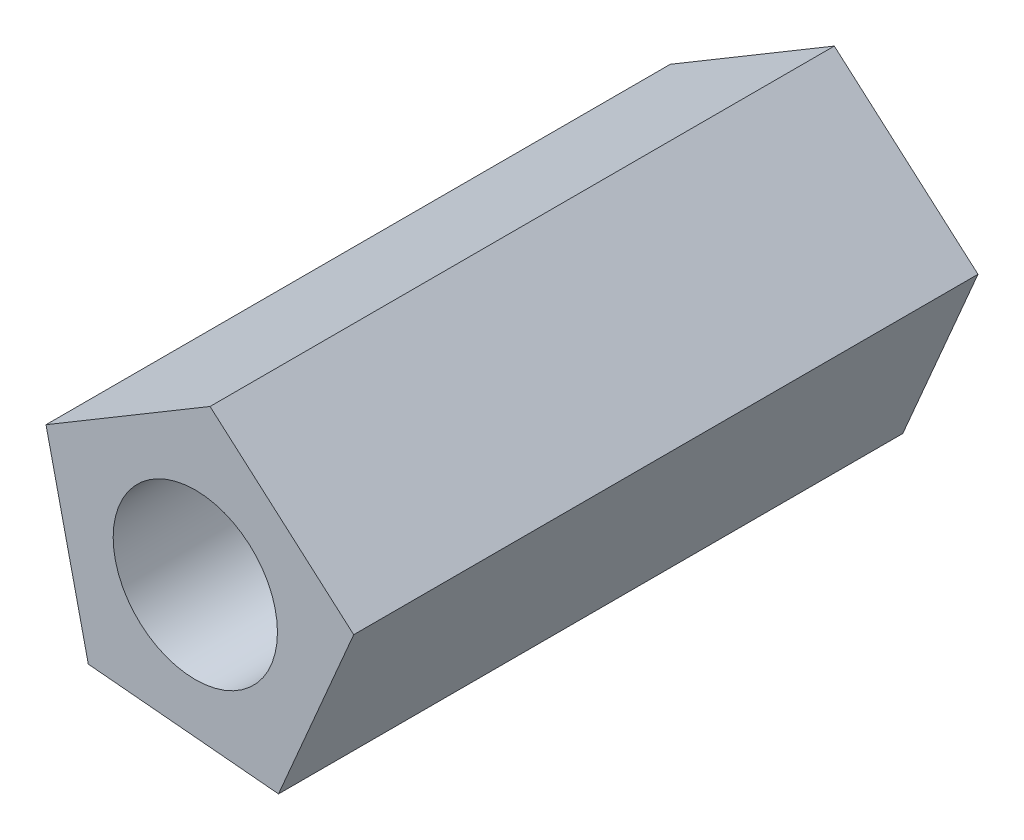
ISO-10303-21;
HEADER;
FILE_DESCRIPTION(('STEP AP214'),'2;1');
FILE_NAME('part.step','',(''),(''),'','','');
FILE_SCHEMA(('AUTOMOTIVE_DESIGN { 1 0 10303 214 1 1 1 1 }'));
ENDSEC;
DATA;
#1=APPLICATION_CONTEXT('core data for automotive mechanical design processes');
#2=APPLICATION_PROTOCOL_DEFINITION('international standard','automotive_design',2000,#1);
#3=PRODUCT_CONTEXT('',#1,'mechanical');
#4=PRODUCT('Part','Part','',(#3));
#5=PRODUCT_RELATED_PRODUCT_CATEGORY('part','',(#4));
#6=PRODUCT_DEFINITION_FORMATION('','',#4);
#7=PRODUCT_DEFINITION_CONTEXT('part definition',#1,'design');
#8=PRODUCT_DEFINITION('design','',#6,#7);
#9=PRODUCT_DEFINITION_SHAPE('','',#8);
#10=(LENGTH_UNIT() NAMED_UNIT(*) SI_UNIT(.MILLI.,.METRE.));
#11=(NAMED_UNIT(*) PLANE_ANGLE_UNIT() SI_UNIT($,.RADIAN.));
#12=(NAMED_UNIT(*) SI_UNIT($,.STERADIAN.) SOLID_ANGLE_UNIT());
#13=UNCERTAINTY_MEASURE_WITH_UNIT(LENGTH_MEASURE(1.E-05),#10,'distance_accuracy_value','');
#14=(GEOMETRIC_REPRESENTATION_CONTEXT(3) GLOBAL_UNCERTAINTY_ASSIGNED_CONTEXT((#13)) GLOBAL_UNIT_ASSIGNED_CONTEXT((#10,
#11,#12)) REPRESENTATION_CONTEXT('',''));
#15=CARTESIAN_POINT('',(0.,0.,0.));
#16=DIRECTION('',(0.,0.,1.));
#17=DIRECTION('',(1.,0.,0.));
#18=AXIS2_PLACEMENT_3D('',#15,#16,#17);
#19=CARTESIAN_POINT('',(0.,0.,19.));
#20=DIRECTION('',(0.,0.,1.));
#21=DIRECTION('',(1.,0.,0.));
#22=AXIS2_PLACEMENT_3D('',#19,#20,#21);
#23=PLANE('',#22);
#24=DIRECTION('',(-0.752435706118176,0.658665702886102,0.));
#25=VECTOR('',#24,1.);
#26=CARTESIAN_POINT('',(4.8213689718828,1.09554824493152,19.));
#27=LINE('',#26,#25);
#28=CARTESIAN_POINT('',(4.8213689718828,1.09554824493152,19.));
#29=VERTEX_POINT('',#28);
#30=CARTESIAN_POINT('',(0.447956651206014,4.92393740401389,19.));
#31=VERTEX_POINT('',#30);
#32=EDGE_CURVE('E116',#29,#31,#27,.T.);
#33=ORIENTED_EDGE('',*,*,#32,.T.);
#34=DIRECTION('',(-0.858943729154984,-0.512069985593111,0.));
#35=VECTOR('',#34,1.);
#36=CARTESIAN_POINT('',(0.447956651206014,4.92393740401389,19.));
#37=LINE('',#36,#35);
#38=CARTESIAN_POINT('',(-4.5445165359509,1.94761242922599,19.));
#39=VERTEX_POINT('',#38);
#40=EDGE_CURVE('E83',#31,#39,#37,.T.);
#41=ORIENTED_EDGE('',*,*,#40,.T.);
#42=DIRECTION('',(0.221579287076811,-0.975142358601313,0.));
#43=VECTOR('',#42,1.);
#44=CARTESIAN_POINT('',(-4.5445165359509,1.94761242922599,19.));
#45=LINE('',#44,#43);
#46=CARTESIAN_POINT('',(-3.2566223328596,-3.72024672584048,19.));
#47=VERTEX_POINT('',#46);
#48=EDGE_CURVE('E87',#39,#47,#45,.T.);
#49=ORIENTED_EDGE('',*,*,#48,.T.);
#50=DIRECTION('',(0.995887259771424,-0.0906011358922389,0.));
#51=VECTOR('',#50,1.);
#52=CARTESIAN_POINT('',(-3.2566223328596,-3.72024672584048,19.));
#53=LINE('',#52,#51);
#54=CARTESIAN_POINT('',(2.53181324572169,-4.24685135233092,19.));
#55=VERTEX_POINT('',#54);
#56=EDGE_CURVE('E91',#47,#55,#53,.T.);
#57=ORIENTED_EDGE('',*,*,#56,.T.);
#58=DIRECTION('',(0.393912888424924,0.919147777200561,0.));
#59=VECTOR('',#58,1.);
#60=CARTESIAN_POINT('',(2.53181324572169,-4.24685135233092,19.));
#61=LINE('',#60,#59);
#62=EDGE_CURVE('E49',#55,#29,#61,.T.);
#63=ORIENTED_EDGE('',*,*,#62,.T.);
#64=EDGE_LOOP('',(#33,#41,#49,#57,#63));
#65=FACE_BOUND('',#64,.T.);
#66=CARTESIAN_POINT('',(0.,0.,19.));
#67=DIRECTION('',(0.,0.,1.));
#68=DIRECTION('',(1.,0.,0.));
#69=AXIS2_PLACEMENT_3D('',#66,#67,#68);
#70=CIRCLE('',#69,2.5);
#71=CARTESIAN_POINT('',(2.5,0.,19.));
#72=VERTEX_POINT('',#71);
#73=EDGE_CURVE('E111',#72,#72,#70,.T.);
#74=ORIENTED_EDGE('',*,*,#73,.F.);
#75=EDGE_LOOP('',(#74));
#76=FACE_BOUND('',#75,.T.);
#77=ADVANCED_FACE('F32',(#65,#76),#23,.T.);
#78=CARTESIAN_POINT('',(0.,0.,0.));
#79=DIRECTION('',(0.,0.,1.));
#80=DIRECTION('',(1.,0.,0.));
#81=AXIS2_PLACEMENT_3D('',#78,#79,#80);
#82=PLANE('',#81);
#83=DIRECTION('',(-0.752435706118176,0.658665702886102,0.));
#84=VECTOR('',#83,1.);
#85=CARTESIAN_POINT('',(4.8213689718828,1.09554824493152,0.));
#86=LINE('',#85,#84);
#87=CARTESIAN_POINT('',(4.8213689718828,1.09554824493152,0.));
#88=VERTEX_POINT('',#87);
#89=CARTESIAN_POINT('',(0.447956651206014,4.92393740401389,0.));
#90=VERTEX_POINT('',#89);
#91=EDGE_CURVE('E107',#88,#90,#86,.T.);
#92=ORIENTED_EDGE('',*,*,#91,.F.);
#93=DIRECTION('',(0.393912888424924,0.919147777200561,0.));
#94=VECTOR('',#93,1.);
#95=CARTESIAN_POINT('',(2.53181324572169,-4.24685135233092,0.));
#96=LINE('',#95,#94);
#97=CARTESIAN_POINT('',(2.53181324572169,-4.24685135233092,0.));
#98=VERTEX_POINT('',#97);
#99=EDGE_CURVE('E75',#98,#88,#96,.T.);
#100=ORIENTED_EDGE('',*,*,#99,.F.);
#101=DIRECTION('',(0.995887259771424,-0.0906011358922389,0.));
#102=VECTOR('',#101,1.);
#103=CARTESIAN_POINT('',(-3.2566223328596,-3.72024672584048,0.));
#104=LINE('',#103,#102);
#105=CARTESIAN_POINT('',(-3.2566223328596,-3.72024672584048,0.));
#106=VERTEX_POINT('',#105);
#107=EDGE_CURVE('E69',#106,#98,#104,.T.);
#108=ORIENTED_EDGE('',*,*,#107,.F.);
#109=DIRECTION('',(0.221579287076811,-0.975142358601313,0.));
#110=VECTOR('',#109,1.);
#111=CARTESIAN_POINT('',(-4.5445165359509,1.94761242922599,0.));
#112=LINE('',#111,#110);
#113=CARTESIAN_POINT('',(-4.5445165359509,1.94761242922599,0.));
#114=VERTEX_POINT('',#113);
#115=EDGE_CURVE('E98',#114,#106,#112,.T.);
#116=ORIENTED_EDGE('',*,*,#115,.F.);
#117=DIRECTION('',(-0.858943729154984,-0.512069985593111,0.));
#118=VECTOR('',#117,1.);
#119=CARTESIAN_POINT('',(0.447956651206014,4.92393740401389,0.));
#120=LINE('',#119,#118);
#121=EDGE_CURVE('E110',#90,#114,#120,.T.);
#122=ORIENTED_EDGE('',*,*,#121,.F.);
#123=EDGE_LOOP('',(#92,#100,#108,#116,#122));
#124=FACE_BOUND('',#123,.T.);
#125=CARTESIAN_POINT('',(0.,0.,0.));
#126=DIRECTION('',(0.,0.,1.));
#127=DIRECTION('',(1.,0.,0.));
#128=AXIS2_PLACEMENT_3D('',#125,#126,#127);
#129=CIRCLE('',#128,2.5);
#130=CARTESIAN_POINT('',(2.5,0.,0.));
#131=VERTEX_POINT('',#130);
#132=EDGE_CURVE('E196',#131,#131,#129,.T.);
#133=ORIENTED_EDGE('',*,*,#132,.T.);
#134=EDGE_LOOP('',(#133));
#135=FACE_BOUND('',#134,.T.);
#136=ADVANCED_FACE('F120',(#124,#135),#82,.F.);
#137=CARTESIAN_POINT('',(4.8213689718828,1.09554824493152,19.));
#138=DIRECTION('',(-0.658665702886102,-0.752435706118176,0.));
#139=DIRECTION('',(0.752435706118176,-0.658665702886102,0.));
#140=AXIS2_PLACEMENT_3D('',#137,#138,#139);
#141=PLANE('',#140);
#142=ORIENTED_EDGE('',*,*,#91,.T.);
#143=DIRECTION('',(0.,0.,-1.));
#144=VECTOR('',#143,1.);
#145=CARTESIAN_POINT('',(0.447956651206014,4.92393740401389,19.));
#146=LINE('',#145,#144);
#147=EDGE_CURVE('E11',#31,#90,#146,.T.);
#148=ORIENTED_EDGE('',*,*,#147,.F.);
#149=ORIENTED_EDGE('',*,*,#32,.F.);
#150=DIRECTION('',(0.,0.,-1.));
#151=VECTOR('',#150,1.);
#152=CARTESIAN_POINT('',(4.8213689718828,1.09554824493152,19.));
#153=LINE('',#152,#151);
#154=EDGE_CURVE('E103',#29,#88,#153,.T.);
#155=ORIENTED_EDGE('',*,*,#154,.T.);
#156=EDGE_LOOP('',(#142,#148,#149,#155));
#157=FACE_BOUND('',#156,.T.);
#158=ADVANCED_FACE('F34',(#157),#141,.F.);
#159=CARTESIAN_POINT('',(0.447956651206014,4.92393740401389,19.));
#160=DIRECTION('',(0.512069985593111,-0.858943729154984,0.));
#161=DIRECTION('',(0.858943729154984,0.512069985593111,0.));
#162=AXIS2_PLACEMENT_3D('',#159,#160,#161);
#163=PLANE('',#162);
#164=ORIENTED_EDGE('',*,*,#121,.T.);
#165=DIRECTION('',(0.,0.,-1.));
#166=VECTOR('',#165,1.);
#167=CARTESIAN_POINT('',(-4.5445165359509,1.94761242922599,19.));
#168=LINE('',#167,#166);
#169=EDGE_CURVE('E41',#39,#114,#168,.T.);
#170=ORIENTED_EDGE('',*,*,#169,.F.);
#171=ORIENTED_EDGE('',*,*,#40,.F.);
#172=ORIENTED_EDGE('',*,*,#147,.T.);
#173=EDGE_LOOP('',(#164,#170,#171,#172));
#174=FACE_BOUND('',#173,.T.);
#175=ADVANCED_FACE('F145',(#174),#163,.F.);
#176=CARTESIAN_POINT('',(-4.5445165359509,1.94761242922599,19.));
#177=DIRECTION('',(0.975142358601313,0.221579287076811,0.));
#178=DIRECTION('',(-0.221579287076811,0.975142358601313,0.));
#179=AXIS2_PLACEMENT_3D('',#176,#177,#178);
#180=PLANE('',#179);
#181=ORIENTED_EDGE('',*,*,#115,.T.);
#182=DIRECTION('',(0.,0.,-1.));
#183=VECTOR('',#182,1.);
#184=CARTESIAN_POINT('',(-3.2566223328596,-3.72024672584048,19.));
#185=LINE('',#184,#183);
#186=EDGE_CURVE('E95',#47,#106,#185,.T.);
#187=ORIENTED_EDGE('',*,*,#186,.F.);
#188=ORIENTED_EDGE('',*,*,#48,.F.);
#189=ORIENTED_EDGE('',*,*,#169,.T.);
#190=EDGE_LOOP('',(#181,#187,#188,#189));
#191=FACE_BOUND('',#190,.T.);
#192=ADVANCED_FACE('F96',(#191),#180,.F.);
#193=CARTESIAN_POINT('',(-3.2566223328596,-3.72024672584048,19.));
#194=DIRECTION('',(0.0906011358922389,0.995887259771424,0.));
#195=DIRECTION('',(-0.995887259771424,0.0906011358922389,0.));
#196=AXIS2_PLACEMENT_3D('',#193,#194,#195);
#197=PLANE('',#196);
#198=ORIENTED_EDGE('',*,*,#107,.T.);
#199=DIRECTION('',(0.,0.,-1.));
#200=VECTOR('',#199,1.);
#201=CARTESIAN_POINT('',(2.53181324572169,-4.24685135233092,19.));
#202=LINE('',#201,#200);
#203=EDGE_CURVE('E99',#55,#98,#202,.T.);
#204=ORIENTED_EDGE('',*,*,#203,.F.);
#205=ORIENTED_EDGE('',*,*,#56,.F.);
#206=ORIENTED_EDGE('',*,*,#186,.T.);
#207=EDGE_LOOP('',(#198,#204,#205,#206));
#208=FACE_BOUND('',#207,.T.);
#209=ADVANCED_FACE('F101',(#208),#197,.F.);
#210=CARTESIAN_POINT('',(2.53181324572169,-4.24685135233092,19.));
#211=DIRECTION('',(-0.919147777200562,0.393912888424925,0.));
#212=DIRECTION('',(-0.393912888424925,-0.919147777200562,0.));
#213=AXIS2_PLACEMENT_3D('',#210,#211,#212);
#214=PLANE('',#213);
#215=ORIENTED_EDGE('',*,*,#99,.T.);
#216=ORIENTED_EDGE('',*,*,#154,.F.);
#217=ORIENTED_EDGE('',*,*,#62,.F.);
#218=ORIENTED_EDGE('',*,*,#203,.T.);
#219=EDGE_LOOP('',(#215,#216,#217,#218));
#220=FACE_BOUND('',#219,.T.);
#221=ADVANCED_FACE('F125',(#220),#214,.F.);
#222=CARTESIAN_POINT('',(0.,0.,19.));
#223=DIRECTION('',(0.,0.,-1.));
#224=DIRECTION('',(-1.,0.,0.));
#225=AXIS2_PLACEMENT_3D('',#222,#223,#224);
#226=CYLINDRICAL_SURFACE('',#225,2.5);
#227=ORIENTED_EDGE('',*,*,#73,.T.);
#228=EDGE_LOOP('',(#227));
#229=FACE_BOUND('',#228,.T.);
#230=ORIENTED_EDGE('',*,*,#132,.F.);
#231=EDGE_LOOP('',(#230));
#232=FACE_BOUND('',#231,.T.);
#233=ADVANCED_FACE('F127',(#229,#232),#226,.F.);
#234=CLOSED_SHELL('',(#77,#136,#158,#175,#192,#209,#221,#233));
#235=MANIFOLD_SOLID_BREP('B2',#234);
#236=ADVANCED_BREP_SHAPE_REPRESENTATION('',(#18,#235),#14);
#237=SHAPE_DEFINITION_REPRESENTATION(#9,#236);
ENDSEC;
END-ISO-10303-21;
